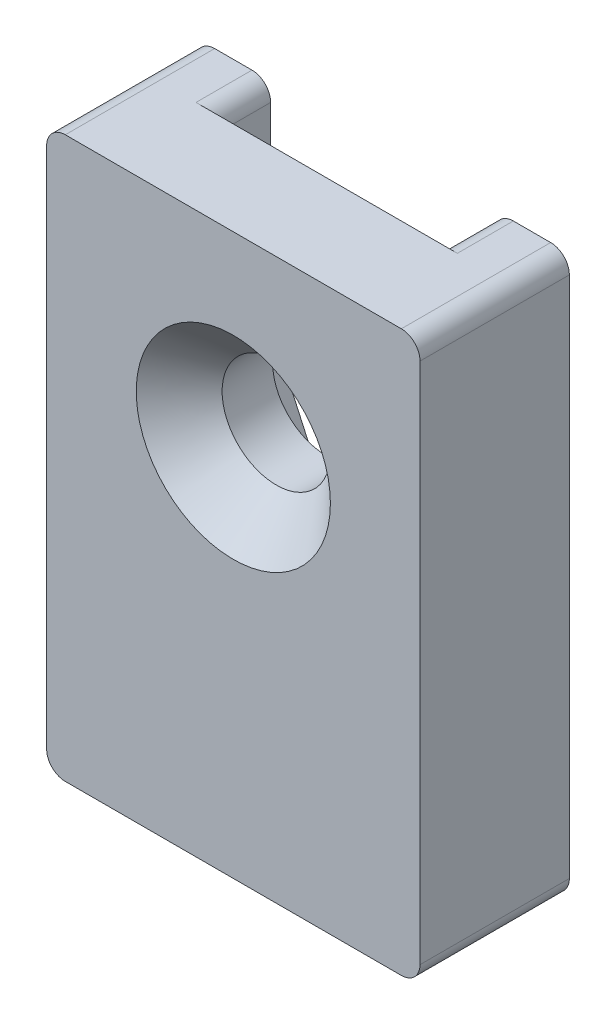
ISO-10303-21;
HEADER;
FILE_DESCRIPTION(('STEP AP214'),'2;1');
FILE_NAME('part.step','',(''),(''),'','','');
FILE_SCHEMA(('AUTOMOTIVE_DESIGN { 1 0 10303 214 1 1 1 1 }'));
ENDSEC;
DATA;
#1=APPLICATION_CONTEXT('core data for automotive mechanical design processes');
#2=APPLICATION_PROTOCOL_DEFINITION('international standard','automotive_design',2000,#1);
#3=PRODUCT_CONTEXT('',#1,'mechanical');
#4=PRODUCT('Part','Part','',(#3));
#5=PRODUCT_RELATED_PRODUCT_CATEGORY('part','',(#4));
#6=PRODUCT_DEFINITION_FORMATION('','',#4);
#7=PRODUCT_DEFINITION_CONTEXT('part definition',#1,'design');
#8=PRODUCT_DEFINITION('design','',#6,#7);
#9=PRODUCT_DEFINITION_SHAPE('','',#8);
#10=(LENGTH_UNIT() NAMED_UNIT(*) SI_UNIT(.MILLI.,.METRE.));
#11=(NAMED_UNIT(*) PLANE_ANGLE_UNIT() SI_UNIT($,.RADIAN.));
#12=(NAMED_UNIT(*) SI_UNIT($,.STERADIAN.) SOLID_ANGLE_UNIT());
#13=UNCERTAINTY_MEASURE_WITH_UNIT(LENGTH_MEASURE(1.E-05),#10,'distance_accuracy_value','');
#14=(GEOMETRIC_REPRESENTATION_CONTEXT(3) GLOBAL_UNCERTAINTY_ASSIGNED_CONTEXT((#13)) GLOBAL_UNIT_ASSIGNED_CONTEXT((#10,
#11,#12)) REPRESENTATION_CONTEXT('',''));
#15=CARTESIAN_POINT('',(0.,0.,0.));
#16=DIRECTION('',(0.,0.,1.));
#17=DIRECTION('',(1.,0.,0.));
#18=AXIS2_PLACEMENT_3D('',#15,#16,#17);
#19=CARTESIAN_POINT('',(-6.,15.,-1.));
#20=DIRECTION('',(-1.,0.,0.));
#21=DIRECTION('',(0.,-1.,0.));
#22=AXIS2_PLACEMENT_3D('',#19,#20,#21);
#23=PLANE('',#22);
#24=DIRECTION('',(0.,1.,0.));
#25=VECTOR('',#24,1.);
#26=CARTESIAN_POINT('',(-6.,15.,-4.));
#27=LINE('',#26,#25);
#28=CARTESIAN_POINT('',(-6.,5.,-4.));
#29=VERTEX_POINT('',#28);
#30=CARTESIAN_POINT('',(-6.,14.,-4.));
#31=VERTEX_POINT('',#30);
#32=EDGE_CURVE('E206',#29,#31,#27,.T.);
#33=ORIENTED_EDGE('',*,*,#32,.T.);
#34=DIRECTION('',(0.,0.,-1.));
#35=VECTOR('',#34,1.);
#36=CARTESIAN_POINT('',(-6.,14.,-1.));
#37=LINE('',#36,#35);
#38=CARTESIAN_POINT('',(-6.,14.,-1.));
#39=VERTEX_POINT('',#38);
#40=EDGE_CURVE('E62',#31,#39,#37,.F.);
#41=ORIENTED_EDGE('',*,*,#40,.T.);
#42=DIRECTION('',(0.,1.,0.));
#43=VECTOR('',#42,1.);
#44=CARTESIAN_POINT('',(-6.,15.,-1.));
#45=LINE('',#44,#43);
#46=CARTESIAN_POINT('',(-6.,5.,-1.));
#47=VERTEX_POINT('',#46);
#48=EDGE_CURVE('E209',#47,#39,#45,.T.);
#49=ORIENTED_EDGE('',*,*,#48,.F.);
#50=DIRECTION('',(0.,0.,1.));
#51=VECTOR('',#50,1.);
#52=CARTESIAN_POINT('',(-6.,5.,-25.7313138121007));
#53=LINE('',#52,#51);
#54=EDGE_CURVE('E176',#29,#47,#53,.T.);
#55=ORIENTED_EDGE('',*,*,#54,.F.);
#56=EDGE_LOOP('',(#33,#41,#49,#55));
#57=FACE_BOUND('',#56,.T.);
#58=ADVANCED_FACE('F39',(#57),#23,.F.);
#59=CARTESIAN_POINT('',(0.,0.,-1.));
#60=DIRECTION('',(0.,0.,-1.));
#61=DIRECTION('',(-1.,0.,0.));
#62=AXIS2_PLACEMENT_3D('',#59,#60,#61);
#63=PLANE('',#62);
#64=CARTESIAN_POINT('',(0.,5.,-1.));
#65=DIRECTION('',(0.,0.,-1.));
#66=DIRECTION('',(-1.,0.,0.));
#67=AXIS2_PLACEMENT_3D('',#64,#65,#66);
#68=CIRCLE('',#67,2.89999999999999);
#69=CARTESIAN_POINT('',(-2.89999999999999,5.,-1.));
#70=VERTEX_POINT('',#69);
#71=EDGE_CURVE('E200',#70,#70,#68,.T.);
#72=ORIENTED_EDGE('',*,*,#71,.F.);
#73=EDGE_LOOP('',(#72));
#74=FACE_BOUND('',#73,.T.);
#75=DIRECTION('',(-1.,0.,0.));
#76=VECTOR('',#75,1.);
#77=CARTESIAN_POINT('',(5.99999999999999,-15.,-1.));
#78=LINE('',#77,#76);
#79=CARTESIAN_POINT('',(7.,-15.,-1.));
#80=VERTEX_POINT('',#79);
#81=CARTESIAN_POINT('',(0.947008471079007,-15.,-1.));
#82=VERTEX_POINT('',#81);
#83=EDGE_CURVE('E205',#80,#82,#78,.T.);
#84=ORIENTED_EDGE('',*,*,#83,.T.);
#85=CARTESIAN_POINT('',(0.947008471079007,-14.,-1.));
#86=DIRECTION('',(0.,0.,-1.));
#87=DIRECTION('',(-1.,0.,0.));
#88=AXIS2_PLACEMENT_3D('',#85,#86,#87);
#89=CIRCLE('',#88,1.);
#90=CARTESIAN_POINT('',(1.85737801716609,-13.5862038067391,-1.));
#91=VERTEX_POINT('',#90);
#92=EDGE_CURVE('E48',#82,#91,#89,.F.);
#93=ORIENTED_EDGE('',*,*,#92,.T.);
#94=DIRECTION('',(0.413796193260886,-0.910369546087082,0.));
#95=VECTOR('',#94,1.);
#96=CARTESIAN_POINT('',(-5.4622172765225,2.51722284043469,-1.));
#97=LINE('',#96,#95);
#98=CARTESIAN_POINT('',(-5.4622172765225,2.51722284043469,-1.));
#99=VERTEX_POINT('',#98);
#100=EDGE_CURVE('E169',#99,#91,#97,.T.);
#101=ORIENTED_EDGE('',*,*,#100,.F.);
#102=CARTESIAN_POINT('',(0.,5.,-1.));
#103=DIRECTION('',(0.,0.,1.));
#104=DIRECTION('',(1.,0.,0.));
#105=AXIS2_PLACEMENT_3D('',#102,#103,#104);
#106=CIRCLE('',#105,6.00000000000001);
#107=EDGE_CURVE('E179',#47,#99,#106,.T.);
#108=ORIENTED_EDGE('',*,*,#107,.F.);
#109=ORIENTED_EDGE('',*,*,#48,.T.);
#110=CARTESIAN_POINT('',(-7.,14.,-1.));
#111=DIRECTION('',(0.,0.,-1.));
#112=DIRECTION('',(-1.,0.,0.));
#113=AXIS2_PLACEMENT_3D('',#110,#111,#112);
#114=CIRCLE('',#113,1.);
#115=CARTESIAN_POINT('',(-7.,15.,-1.));
#116=VERTEX_POINT('',#115);
#117=EDGE_CURVE('E353',#39,#116,#114,.F.);
#118=ORIENTED_EDGE('',*,*,#117,.T.);
#119=DIRECTION('',(1.,0.,0.));
#120=VECTOR('',#119,1.);
#121=CARTESIAN_POINT('',(6.,15.,-1.));
#122=LINE('',#121,#120);
#123=CARTESIAN_POINT('',(7.,15.,-1.));
#124=VERTEX_POINT('',#123);
#125=EDGE_CURVE('E212',#116,#124,#122,.T.);
#126=ORIENTED_EDGE('',*,*,#125,.T.);
#127=CARTESIAN_POINT('',(7.,14.,-1.));
#128=DIRECTION('',(0.,0.,-1.));
#129=DIRECTION('',(-1.,0.,0.));
#130=AXIS2_PLACEMENT_3D('',#127,#128,#129);
#131=CIRCLE('',#130,1.);
#132=CARTESIAN_POINT('',(6.,14.,-1.));
#133=VERTEX_POINT('',#132);
#134=EDGE_CURVE('E350',#124,#133,#131,.F.);
#135=ORIENTED_EDGE('',*,*,#134,.T.);
#136=DIRECTION('',(0.,-1.,0.));
#137=VECTOR('',#136,1.);
#138=CARTESIAN_POINT('',(6.,15.,-1.));
#139=LINE('',#138,#137);
#140=CARTESIAN_POINT('',(5.99999999999999,-14.,-1.));
#141=VERTEX_POINT('',#140);
#142=EDGE_CURVE('E201',#133,#141,#139,.T.);
#143=ORIENTED_EDGE('',*,*,#142,.T.);
#144=CARTESIAN_POINT('',(7.,-14.,-1.));
#145=DIRECTION('',(0.,0.,-1.));
#146=DIRECTION('',(-1.,0.,0.));
#147=AXIS2_PLACEMENT_3D('',#144,#145,#146);
#148=CIRCLE('',#147,1.);
#149=EDGE_CURVE('E11',#141,#80,#148,.F.);
#150=ORIENTED_EDGE('',*,*,#149,.T.);
#151=EDGE_LOOP('',(#84,#93,#101,#108,#109,#118,#126,#135,#143,#150));
#152=FACE_BOUND('',#151,.T.);
#153=ADVANCED_FACE('F184',(#74,#152),#63,.T.);
#154=CARTESIAN_POINT('',(0.,0.,-4.));
#155=DIRECTION('',(0.,0.,1.));
#156=DIRECTION('',(1.,0.,0.));
#157=AXIS2_PLACEMENT_3D('',#154,#155,#156);
#158=PLANE('',#157);
#159=DIRECTION('',(-1.,0.,0.));
#160=VECTOR('',#159,1.);
#161=CARTESIAN_POINT('',(-10.,15.,-4.));
#162=LINE('',#161,#160);
#163=CARTESIAN_POINT('',(8.99999999999999,15.,-4.));
#164=VERTEX_POINT('',#163);
#165=CARTESIAN_POINT('',(7.,15.,-4.));
#166=VERTEX_POINT('',#165);
#167=EDGE_CURVE('E237',#164,#166,#162,.T.);
#168=ORIENTED_EDGE('',*,*,#167,.F.);
#169=CARTESIAN_POINT('',(8.99999999999999,14.,-4.));
#170=DIRECTION('',(0.,0.,1.));
#171=DIRECTION('',(1.,0.,0.));
#172=AXIS2_PLACEMENT_3D('',#169,#170,#171);
#173=CIRCLE('',#172,1.);
#174=CARTESIAN_POINT('',(9.99999999999999,14.,-4.));
#175=VERTEX_POINT('',#174);
#176=EDGE_CURVE('E320',#164,#175,#173,.F.);
#177=ORIENTED_EDGE('',*,*,#176,.T.);
#178=DIRECTION('',(0.,1.,0.));
#179=VECTOR('',#178,1.);
#180=CARTESIAN_POINT('',(9.99999999999999,15.,-4.));
#181=LINE('',#180,#179);
#182=CARTESIAN_POINT('',(10.,-14.,-4.));
#183=VERTEX_POINT('',#182);
#184=EDGE_CURVE('E232',#183,#175,#181,.T.);
#185=ORIENTED_EDGE('',*,*,#184,.F.);
#186=CARTESIAN_POINT('',(9.,-14.,-4.));
#187=DIRECTION('',(0.,0.,1.));
#188=DIRECTION('',(1.,0.,0.));
#189=AXIS2_PLACEMENT_3D('',#186,#187,#188);
#190=CIRCLE('',#189,1.);
#191=CARTESIAN_POINT('',(9.,-15.,-4.));
#192=VERTEX_POINT('',#191);
#193=EDGE_CURVE('E317',#183,#192,#190,.F.);
#194=ORIENTED_EDGE('',*,*,#193,.T.);
#195=DIRECTION('',(1.,0.,0.));
#196=VECTOR('',#195,1.);
#197=CARTESIAN_POINT('',(-10.,-15.,-4.));
#198=LINE('',#197,#196);
#199=CARTESIAN_POINT('',(7.,-15.,-4.));
#200=VERTEX_POINT('',#199);
#201=EDGE_CURVE('E226',#200,#192,#198,.T.);
#202=ORIENTED_EDGE('',*,*,#201,.F.);
#203=CARTESIAN_POINT('',(7.,-14.,-4.));
#204=DIRECTION('',(0.,0.,1.));
#205=DIRECTION('',(1.,0.,0.));
#206=AXIS2_PLACEMENT_3D('',#203,#204,#205);
#207=CIRCLE('',#206,1.);
#208=CARTESIAN_POINT('',(5.99999999999999,-14.,-4.));
#209=VERTEX_POINT('',#208);
#210=EDGE_CURVE('E311',#200,#209,#207,.F.);
#211=ORIENTED_EDGE('',*,*,#210,.T.);
#212=DIRECTION('',(0.,-1.,0.));
#213=VECTOR('',#212,1.);
#214=CARTESIAN_POINT('',(6.,15.,-4.));
#215=LINE('',#214,#213);
#216=CARTESIAN_POINT('',(6.,14.,-4.));
#217=VERTEX_POINT('',#216);
#218=EDGE_CURVE('E216',#217,#209,#215,.T.);
#219=ORIENTED_EDGE('',*,*,#218,.F.);
#220=CARTESIAN_POINT('',(7.,14.,-4.));
#221=DIRECTION('',(0.,0.,1.));
#222=DIRECTION('',(1.,0.,0.));
#223=AXIS2_PLACEMENT_3D('',#220,#221,#222);
#224=CIRCLE('',#223,1.);
#225=EDGE_CURVE('E314',#217,#166,#224,.F.);
#226=ORIENTED_EDGE('',*,*,#225,.T.);
#227=EDGE_LOOP('',(#168,#177,#185,#194,#202,#211,#219,#226));
#228=FACE_BOUND('',#227,.T.);
#229=ADVANCED_FACE('F389',(#228),#158,.F.);
#230=CARTESIAN_POINT('',(-10.,15.,-4.));
#231=DIRECTION('',(-1.,0.,0.));
#232=DIRECTION('',(0.,-1.,0.));
#233=AXIS2_PLACEMENT_3D('',#230,#231,#232);
#234=PLANE('',#233);
#235=DIRECTION('',(0.,-1.,0.));
#236=VECTOR('',#235,1.);
#237=CARTESIAN_POINT('',(-10.,15.,4.));
#238=LINE('',#237,#236);
#239=CARTESIAN_POINT('',(-10.,14.,4.));
#240=VERTEX_POINT('',#239);
#241=CARTESIAN_POINT('',(-10.,-14.,4.));
#242=VERTEX_POINT('',#241);
#243=EDGE_CURVE('E215',#240,#242,#238,.T.);
#244=ORIENTED_EDGE('',*,*,#243,.F.);
#245=DIRECTION('',(0.,0.,1.));
#246=VECTOR('',#245,1.);
#247=CARTESIAN_POINT('',(-10.,14.,-4.));
#248=LINE('',#247,#246);
#249=CARTESIAN_POINT('',(-10.,14.,-4.));
#250=VERTEX_POINT('',#249);
#251=EDGE_CURVE('E289',#240,#250,#248,.F.);
#252=ORIENTED_EDGE('',*,*,#251,.T.);
#253=DIRECTION('',(0.,-1.,0.));
#254=VECTOR('',#253,1.);
#255=CARTESIAN_POINT('',(-10.,15.,-4.));
#256=LINE('',#255,#254);
#257=CARTESIAN_POINT('',(-10.,-14.,-4.));
#258=VERTEX_POINT('',#257);
#259=EDGE_CURVE('E222',#250,#258,#256,.T.);
#260=ORIENTED_EDGE('',*,*,#259,.T.);
#261=DIRECTION('',(0.,0.,1.));
#262=VECTOR('',#261,1.);
#263=CARTESIAN_POINT('',(-10.,-14.,-4.));
#264=LINE('',#263,#262);
#265=EDGE_CURVE('E285',#258,#242,#264,.T.);
#266=ORIENTED_EDGE('',*,*,#265,.T.);
#267=EDGE_LOOP('',(#244,#252,#260,#266));
#268=FACE_BOUND('',#267,.T.);
#269=ADVANCED_FACE('F423',(#268),#234,.T.);
#270=CARTESIAN_POINT('',(-10.,15.,-4.));
#271=DIRECTION('',(0.,1.,0.));
#272=DIRECTION('',(-1.,0.,0.));
#273=AXIS2_PLACEMENT_3D('',#270,#271,#272);
#274=PLANE('',#273);
#275=CARTESIAN_POINT('',(-7.,15.,-4.));
#276=VERTEX_POINT('',#275);
#277=CARTESIAN_POINT('',(-9.00000000000001,15.,-4.));
#278=VERTEX_POINT('',#277);
#279=EDGE_CURVE('E236',#276,#278,#162,.T.);
#280=ORIENTED_EDGE('',*,*,#279,.T.);
#281=DIRECTION('',(0.,0.,1.));
#282=VECTOR('',#281,1.);
#283=CARTESIAN_POINT('',(-9.00000000000001,15.,-4.));
#284=LINE('',#283,#282);
#285=CARTESIAN_POINT('',(-9.00000000000001,15.,4.));
#286=VERTEX_POINT('',#285);
#287=EDGE_CURVE('E269',#278,#286,#284,.T.);
#288=ORIENTED_EDGE('',*,*,#287,.T.);
#289=DIRECTION('',(-1.,0.,0.));
#290=VECTOR('',#289,1.);
#291=CARTESIAN_POINT('',(-10.,15.,4.));
#292=LINE('',#291,#290);
#293=CARTESIAN_POINT('',(8.99999999999999,15.,4.));
#294=VERTEX_POINT('',#293);
#295=EDGE_CURVE('E227',#294,#286,#292,.T.);
#296=ORIENTED_EDGE('',*,*,#295,.F.);
#297=DIRECTION('',(0.,0.,1.));
#298=VECTOR('',#297,1.);
#299=CARTESIAN_POINT('',(8.99999999999999,15.,-4.));
#300=LINE('',#299,#298);
#301=EDGE_CURVE('E266',#294,#164,#300,.F.);
#302=ORIENTED_EDGE('',*,*,#301,.T.);
#303=ORIENTED_EDGE('',*,*,#167,.T.);
#304=DIRECTION('',(0.,0.,-1.));
#305=VECTOR('',#304,1.);
#306=CARTESIAN_POINT('',(7.,15.,-1.));
#307=LINE('',#306,#305);
#308=EDGE_CURVE('E262',#166,#124,#307,.F.);
#309=ORIENTED_EDGE('',*,*,#308,.T.);
#310=ORIENTED_EDGE('',*,*,#125,.F.);
#311=DIRECTION('',(0.,0.,-1.));
#312=VECTOR('',#311,1.);
#313=CARTESIAN_POINT('',(-7.,15.,-4.));
#314=LINE('',#313,#312);
#315=EDGE_CURVE('E241',#116,#276,#314,.T.);
#316=ORIENTED_EDGE('',*,*,#315,.T.);
#317=EDGE_LOOP('',(#280,#288,#296,#302,#303,#309,#310,#316));
#318=FACE_BOUND('',#317,.T.);
#319=ADVANCED_FACE('F374',(#318),#274,.T.);
#320=CARTESIAN_POINT('',(9.99999999999999,15.,-4.));
#321=DIRECTION('',(1.,0.,0.));
#322=DIRECTION('',(0.,1.,0.));
#323=AXIS2_PLACEMENT_3D('',#320,#321,#322);
#324=PLANE('',#323);
#325=ORIENTED_EDGE('',*,*,#184,.T.);
#326=DIRECTION('',(0.,0.,1.));
#327=VECTOR('',#326,1.);
#328=CARTESIAN_POINT('',(9.99999999999999,14.,-4.));
#329=LINE('',#328,#327);
#330=CARTESIAN_POINT('',(9.99999999999999,14.,4.));
#331=VERTEX_POINT('',#330);
#332=EDGE_CURVE('E307',#175,#331,#329,.T.);
#333=ORIENTED_EDGE('',*,*,#332,.T.);
#334=DIRECTION('',(0.,1.,0.));
#335=VECTOR('',#334,1.);
#336=CARTESIAN_POINT('',(9.99999999999999,15.,4.));
#337=LINE('',#336,#335);
#338=CARTESIAN_POINT('',(10.,-14.,4.));
#339=VERTEX_POINT('',#338);
#340=EDGE_CURVE('E249',#339,#331,#337,.T.);
#341=ORIENTED_EDGE('',*,*,#340,.F.);
#342=DIRECTION('',(0.,0.,1.));
#343=VECTOR('',#342,1.);
#344=CARTESIAN_POINT('',(10.,-14.,-4.));
#345=LINE('',#344,#343);
#346=EDGE_CURVE('E304',#339,#183,#345,.F.);
#347=ORIENTED_EDGE('',*,*,#346,.T.);
#348=EDGE_LOOP('',(#325,#333,#341,#347));
#349=FACE_BOUND('',#348,.T.);
#350=ADVANCED_FACE('F399',(#349),#324,.T.);
#351=CARTESIAN_POINT('',(-10.,-15.,-4.));
#352=DIRECTION('',(0.,-1.,0.));
#353=DIRECTION('',(1.,0.,0.));
#354=AXIS2_PLACEMENT_3D('',#351,#352,#353);
#355=PLANE('',#354);
#356=ORIENTED_EDGE('',*,*,#201,.T.);
#357=DIRECTION('',(0.,0.,1.));
#358=VECTOR('',#357,1.);
#359=CARTESIAN_POINT('',(9.,-15.,-4.));
#360=LINE('',#359,#358);
#361=CARTESIAN_POINT('',(9.,-15.,4.));
#362=VERTEX_POINT('',#361);
#363=EDGE_CURVE('E334',#192,#362,#360,.T.);
#364=ORIENTED_EDGE('',*,*,#363,.T.);
#365=DIRECTION('',(1.,0.,0.));
#366=VECTOR('',#365,1.);
#367=CARTESIAN_POINT('',(-10.,-15.,4.));
#368=LINE('',#367,#366);
#369=CARTESIAN_POINT('',(-9.,-15.,4.));
#370=VERTEX_POINT('',#369);
#371=EDGE_CURVE('E245',#370,#362,#368,.T.);
#372=ORIENTED_EDGE('',*,*,#371,.F.);
#373=DIRECTION('',(0.,0.,1.));
#374=VECTOR('',#373,1.);
#375=CARTESIAN_POINT('',(-9.,-15.,-4.));
#376=LINE('',#375,#374);
#377=CARTESIAN_POINT('',(-9.,-15.,-4.));
#378=VERTEX_POINT('',#377);
#379=EDGE_CURVE('E331',#370,#378,#376,.F.);
#380=ORIENTED_EDGE('',*,*,#379,.T.);
#381=CARTESIAN_POINT('',(0.947008471079007,-15.,-4.));
#382=VERTEX_POINT('',#381);
#383=EDGE_CURVE('E231',#378,#382,#198,.T.);
#384=ORIENTED_EDGE('',*,*,#383,.T.);
#385=DIRECTION('',(0.,0.,1.));
#386=VECTOR('',#385,1.);
#387=CARTESIAN_POINT('',(0.947008471079007,-15.,-1.));
#388=LINE('',#387,#386);
#389=EDGE_CURVE('E327',#382,#82,#388,.T.);
#390=ORIENTED_EDGE('',*,*,#389,.T.);
#391=ORIENTED_EDGE('',*,*,#83,.F.);
#392=DIRECTION('',(0.,0.,-1.));
#393=VECTOR('',#392,1.);
#394=CARTESIAN_POINT('',(7.,-15.,-4.));
#395=LINE('',#394,#393);
#396=EDGE_CURVE('E323',#80,#200,#395,.T.);
#397=ORIENTED_EDGE('',*,*,#396,.T.);
#398=EDGE_LOOP('',(#356,#364,#372,#380,#384,#390,#391,#397));
#399=FACE_BOUND('',#398,.T.);
#400=ADVANCED_FACE('F407',(#399),#355,.T.);
#401=ORIENTED_EDGE('',*,*,#259,.F.);
#402=CARTESIAN_POINT('',(-9.00000000000001,14.,-4.));
#403=DIRECTION('',(0.,0.,1.));
#404=DIRECTION('',(1.,0.,0.));
#405=AXIS2_PLACEMENT_3D('',#402,#403,#404);
#406=CIRCLE('',#405,1.);
#407=EDGE_CURVE('E301',#250,#278,#406,.F.);
#408=ORIENTED_EDGE('',*,*,#407,.T.);
#409=ORIENTED_EDGE('',*,*,#279,.F.);
#410=CARTESIAN_POINT('',(-7.,14.,-4.));
#411=DIRECTION('',(0.,0.,1.));
#412=DIRECTION('',(1.,0.,0.));
#413=AXIS2_PLACEMENT_3D('',#410,#411,#412);
#414=CIRCLE('',#413,1.);
#415=EDGE_CURVE('E295',#276,#31,#414,.F.);
#416=ORIENTED_EDGE('',*,*,#415,.T.);
#417=ORIENTED_EDGE('',*,*,#32,.F.);
#418=CARTESIAN_POINT('',(0.,5.,-4.));
#419=DIRECTION('',(0.,0.,1.));
#420=DIRECTION('',(1.,0.,0.));
#421=AXIS2_PLACEMENT_3D('',#418,#419,#420);
#422=CIRCLE('',#421,6.00000000000001);
#423=CARTESIAN_POINT('',(-5.4622172765225,2.51722284043469,-4.));
#424=VERTEX_POINT('',#423);
#425=EDGE_CURVE('E196',#424,#29,#422,.F.);
#426=ORIENTED_EDGE('',*,*,#425,.F.);
#427=DIRECTION('',(-0.413796193260886,0.910369546087082,0.));
#428=VECTOR('',#427,1.);
#429=CARTESIAN_POINT('',(-5.4622172765225,2.51722284043469,-4.));
#430=LINE('',#429,#428);
#431=CARTESIAN_POINT('',(1.85737801716609,-13.5862038067391,-4.));
#432=VERTEX_POINT('',#431);
#433=EDGE_CURVE('E172',#432,#424,#430,.T.);
#434=ORIENTED_EDGE('',*,*,#433,.F.);
#435=CARTESIAN_POINT('',(0.947008471079007,-14.,-4.));
#436=DIRECTION('',(0.,0.,1.));
#437=DIRECTION('',(1.,0.,0.));
#438=AXIS2_PLACEMENT_3D('',#435,#436,#437);
#439=CIRCLE('',#438,1.);
#440=EDGE_CURVE('E292',#432,#382,#439,.F.);
#441=ORIENTED_EDGE('',*,*,#440,.T.);
#442=ORIENTED_EDGE('',*,*,#383,.F.);
#443=CARTESIAN_POINT('',(-9.,-14.,-4.));
#444=DIRECTION('',(0.,0.,1.));
#445=DIRECTION('',(1.,0.,0.));
#446=AXIS2_PLACEMENT_3D('',#443,#444,#445);
#447=CIRCLE('',#446,1.);
#448=EDGE_CURVE('E298',#378,#258,#447,.F.);
#449=ORIENTED_EDGE('',*,*,#448,.T.);
#450=EDGE_LOOP('',(#401,#408,#409,#416,#417,#426,#434,#441,#442,#449));
#451=FACE_BOUND('',#450,.T.);
#452=ADVANCED_FACE('F367',(#451),#158,.F.);
#453=CARTESIAN_POINT('',(0.,0.,4.));
#454=DIRECTION('',(0.,0.,1.));
#455=DIRECTION('',(1.,0.,0.));
#456=AXIS2_PLACEMENT_3D('',#453,#454,#455);
#457=PLANE('',#456);
#458=CARTESIAN_POINT('',(0.,5.,4.));
#459=DIRECTION('',(0.,0.,1.));
#460=DIRECTION('',(1.,0.,0.));
#461=AXIS2_PLACEMENT_3D('',#458,#459,#460);
#462=CIRCLE('',#461,5.2);
#463=CARTESIAN_POINT('',(5.2,5.,4.));
#464=VERTEX_POINT('',#463);
#465=EDGE_CURVE('E191',#464,#464,#462,.T.);
#466=ORIENTED_EDGE('',*,*,#465,.F.);
#467=EDGE_LOOP('',(#466));
#468=FACE_BOUND('',#467,.T.);
#469=ORIENTED_EDGE('',*,*,#295,.T.);
#470=CARTESIAN_POINT('',(-9.00000000000001,14.,4.));
#471=DIRECTION('',(0.,0.,1.));
#472=DIRECTION('',(1.,0.,0.));
#473=AXIS2_PLACEMENT_3D('',#470,#471,#472);
#474=CIRCLE('',#473,1.);
#475=EDGE_CURVE('E282',#286,#240,#474,.T.);
#476=ORIENTED_EDGE('',*,*,#475,.T.);
#477=ORIENTED_EDGE('',*,*,#243,.T.);
#478=CARTESIAN_POINT('',(-9.,-14.,4.));
#479=DIRECTION('',(0.,0.,1.));
#480=DIRECTION('',(1.,0.,0.));
#481=AXIS2_PLACEMENT_3D('',#478,#479,#480);
#482=CIRCLE('',#481,1.);
#483=EDGE_CURVE('E273',#242,#370,#482,.T.);
#484=ORIENTED_EDGE('',*,*,#483,.T.);
#485=ORIENTED_EDGE('',*,*,#371,.T.);
#486=CARTESIAN_POINT('',(9.,-14.,4.));
#487=DIRECTION('',(0.,0.,1.));
#488=DIRECTION('',(1.,0.,0.));
#489=AXIS2_PLACEMENT_3D('',#486,#487,#488);
#490=CIRCLE('',#489,1.);
#491=EDGE_CURVE('E276',#362,#339,#490,.T.);
#492=ORIENTED_EDGE('',*,*,#491,.T.);
#493=ORIENTED_EDGE('',*,*,#340,.T.);
#494=CARTESIAN_POINT('',(8.99999999999999,14.,4.));
#495=DIRECTION('',(0.,0.,1.));
#496=DIRECTION('',(1.,0.,0.));
#497=AXIS2_PLACEMENT_3D('',#494,#495,#496);
#498=CIRCLE('',#497,1.);
#499=EDGE_CURVE('E279',#331,#294,#498,.T.);
#500=ORIENTED_EDGE('',*,*,#499,.T.);
#501=EDGE_LOOP('',(#469,#476,#477,#484,#485,#492,#493,#500));
#502=FACE_BOUND('',#501,.T.);
#503=ADVANCED_FACE('F426',(#468,#502),#457,.T.);
#504=CARTESIAN_POINT('',(6.,15.,-1.));
#505=DIRECTION('',(1.,0.,0.));
#506=DIRECTION('',(0.,1.,0.));
#507=AXIS2_PLACEMENT_3D('',#504,#505,#506);
#508=PLANE('',#507);
#509=ORIENTED_EDGE('',*,*,#142,.F.);
#510=DIRECTION('',(0.,0.,-1.));
#511=VECTOR('',#510,1.);
#512=CARTESIAN_POINT('',(6.,14.,-4.));
#513=LINE('',#512,#511);
#514=EDGE_CURVE('E341',#133,#217,#513,.T.);
#515=ORIENTED_EDGE('',*,*,#514,.T.);
#516=ORIENTED_EDGE('',*,*,#218,.T.);
#517=DIRECTION('',(0.,0.,-1.));
#518=VECTOR('',#517,1.);
#519=CARTESIAN_POINT('',(5.99999999999999,-14.,-1.));
#520=LINE('',#519,#518);
#521=EDGE_CURVE('E338',#209,#141,#520,.F.);
#522=ORIENTED_EDGE('',*,*,#521,.T.);
#523=EDGE_LOOP('',(#509,#515,#516,#522));
#524=FACE_BOUND('',#523,.T.);
#525=ADVANCED_FACE('F383',(#524),#508,.F.);
#526=CARTESIAN_POINT('',(0.,5.,4.));
#527=DIRECTION('',(0.,0.,1.));
#528=DIRECTION('',(1.,0.,0.));
#529=AXIS2_PLACEMENT_3D('',#526,#527,#528);
#530=CYLINDRICAL_SURFACE('',#529,2.89999999999999);
#531=ORIENTED_EDGE('',*,*,#71,.T.);
#532=EDGE_LOOP('',(#531));
#533=FACE_BOUND('',#532,.T.);
#534=CARTESIAN_POINT('',(0.,5.,1.7));
#535=DIRECTION('',(0.,0.,1.));
#536=DIRECTION('',(1.,0.,0.));
#537=AXIS2_PLACEMENT_3D('',#534,#535,#536);
#538=CIRCLE('',#537,2.89999999999999);
#539=CARTESIAN_POINT('',(2.89999999999999,5.,1.7));
#540=VERTEX_POINT('',#539);
#541=EDGE_CURVE('E195',#540,#540,#538,.T.);
#542=ORIENTED_EDGE('',*,*,#541,.T.);
#543=EDGE_LOOP('',(#542));
#544=FACE_BOUND('',#543,.T.);
#545=ADVANCED_FACE('F450',(#533,#544),#530,.F.);
#546=CARTESIAN_POINT('',(0.,5.,4.));
#547=DIRECTION('',(0.,0.,1.));
#548=DIRECTION('',(1.,0.,0.));
#549=AXIS2_PLACEMENT_3D('',#546,#547,#548);
#550=CONICAL_SURFACE('',#549,5.2,0.785398163397451);
#551=ORIENTED_EDGE('',*,*,#541,.F.);
#552=EDGE_LOOP('',(#551));
#553=FACE_BOUND('',#552,.T.);
#554=ORIENTED_EDGE('',*,*,#465,.T.);
#555=EDGE_LOOP('',(#554));
#556=FACE_BOUND('',#555,.T.);
#557=ADVANCED_FACE('F491',(#553,#556),#550,.F.);
#558=CARTESIAN_POINT('',(-5.4622172765225,2.51722284043469,-25.7313138121007));
#559=DIRECTION('',(-0.910369546087082,-0.413796193260886,0.));
#560=DIRECTION('',(0.413796193260886,-0.910369546087082,0.));
#561=AXIS2_PLACEMENT_3D('',#558,#559,#560);
#562=PLANE('',#561);
#563=ORIENTED_EDGE('',*,*,#100,.T.);
#564=DIRECTION('',(0.,0.,1.));
#565=VECTOR('',#564,1.);
#566=CARTESIAN_POINT('',(1.85737801716609,-13.5862038067391,-4.));
#567=LINE('',#566,#565);
#568=EDGE_CURVE('E347',#91,#432,#567,.F.);
#569=ORIENTED_EDGE('',*,*,#568,.T.);
#570=ORIENTED_EDGE('',*,*,#433,.T.);
#571=DIRECTION('',(0.,0.,1.));
#572=VECTOR('',#571,1.);
#573=CARTESIAN_POINT('',(-5.4622172765225,2.51722284043469,-25.7313138121007));
#574=LINE('',#573,#572);
#575=EDGE_CURVE('E166',#424,#99,#574,.T.);
#576=ORIENTED_EDGE('',*,*,#575,.T.);
#577=EDGE_LOOP('',(#563,#569,#570,#576));
#578=FACE_BOUND('',#577,.T.);
#579=ADVANCED_FACE('F168',(#578),#562,.F.);
#580=CARTESIAN_POINT('',(0.,5.,-25.7313138121007));
#581=DIRECTION('',(0.,0.,1.));
#582=DIRECTION('',(1.,0.,0.));
#583=AXIS2_PLACEMENT_3D('',#580,#581,#582);
#584=CYLINDRICAL_SURFACE('',#583,6.00000000000001);
#585=ORIENTED_EDGE('',*,*,#575,.F.);
#586=ORIENTED_EDGE('',*,*,#425,.T.);
#587=ORIENTED_EDGE('',*,*,#54,.T.);
#588=ORIENTED_EDGE('',*,*,#107,.T.);
#589=EDGE_LOOP('',(#585,#586,#587,#588));
#590=FACE_BOUND('',#589,.T.);
#591=ADVANCED_FACE('F180',(#590),#584,.F.);
#592=CARTESIAN_POINT('',(-9.00000000000001,14.,-4.));
#593=DIRECTION('',(0.,0.,1.));
#594=DIRECTION('',(1.,0.,0.));
#595=AXIS2_PLACEMENT_3D('',#592,#593,#594);
#596=CYLINDRICAL_SURFACE('',#595,1.);
#597=ORIENTED_EDGE('',*,*,#407,.F.);
#598=ORIENTED_EDGE('',*,*,#251,.F.);
#599=ORIENTED_EDGE('',*,*,#475,.F.);
#600=ORIENTED_EDGE('',*,*,#287,.F.);
#601=EDGE_LOOP('',(#597,#598,#599,#600));
#602=FACE_BOUND('',#601,.T.);
#603=ADVANCED_FACE('F429',(#602),#596,.T.);
#604=CARTESIAN_POINT('',(8.99999999999999,14.,-4.));
#605=DIRECTION('',(0.,0.,1.));
#606=DIRECTION('',(1.,0.,0.));
#607=AXIS2_PLACEMENT_3D('',#604,#605,#606);
#608=CYLINDRICAL_SURFACE('',#607,1.);
#609=ORIENTED_EDGE('',*,*,#176,.F.);
#610=ORIENTED_EDGE('',*,*,#301,.F.);
#611=ORIENTED_EDGE('',*,*,#499,.F.);
#612=ORIENTED_EDGE('',*,*,#332,.F.);
#613=EDGE_LOOP('',(#609,#610,#611,#612));
#614=FACE_BOUND('',#613,.T.);
#615=ADVANCED_FACE('F394',(#614),#608,.T.);
#616=CARTESIAN_POINT('',(9.,-14.,-4.));
#617=DIRECTION('',(0.,0.,1.));
#618=DIRECTION('',(1.,0.,0.));
#619=AXIS2_PLACEMENT_3D('',#616,#617,#618);
#620=CYLINDRICAL_SURFACE('',#619,1.);
#621=ORIENTED_EDGE('',*,*,#193,.F.);
#622=ORIENTED_EDGE('',*,*,#346,.F.);
#623=ORIENTED_EDGE('',*,*,#491,.F.);
#624=ORIENTED_EDGE('',*,*,#363,.F.);
#625=EDGE_LOOP('',(#621,#622,#623,#624));
#626=FACE_BOUND('',#625,.T.);
#627=ADVANCED_FACE('F403',(#626),#620,.T.);
#628=CARTESIAN_POINT('',(-9.,-14.,-4.));
#629=DIRECTION('',(0.,0.,1.));
#630=DIRECTION('',(1.,0.,0.));
#631=AXIS2_PLACEMENT_3D('',#628,#629,#630);
#632=CYLINDRICAL_SURFACE('',#631,1.);
#633=ORIENTED_EDGE('',*,*,#448,.F.);
#634=ORIENTED_EDGE('',*,*,#379,.F.);
#635=ORIENTED_EDGE('',*,*,#483,.F.);
#636=ORIENTED_EDGE('',*,*,#265,.F.);
#637=EDGE_LOOP('',(#633,#634,#635,#636));
#638=FACE_BOUND('',#637,.T.);
#639=ADVANCED_FACE('F420',(#638),#632,.T.);
#640=CARTESIAN_POINT('',(7.,14.,-1.));
#641=DIRECTION('',(0.,0.,1.));
#642=DIRECTION('',(1.,0.,0.));
#643=AXIS2_PLACEMENT_3D('',#640,#641,#642);
#644=CYLINDRICAL_SURFACE('',#643,1.);
#645=ORIENTED_EDGE('',*,*,#134,.F.);
#646=ORIENTED_EDGE('',*,*,#308,.F.);
#647=ORIENTED_EDGE('',*,*,#225,.F.);
#648=ORIENTED_EDGE('',*,*,#514,.F.);
#649=EDGE_LOOP('',(#645,#646,#647,#648));
#650=FACE_BOUND('',#649,.T.);
#651=ADVANCED_FACE('F386',(#650),#644,.T.);
#652=CARTESIAN_POINT('',(-7.,14.,-4.));
#653=DIRECTION('',(0.,0.,1.));
#654=DIRECTION('',(1.,0.,0.));
#655=AXIS2_PLACEMENT_3D('',#652,#653,#654);
#656=CYLINDRICAL_SURFACE('',#655,1.);
#657=ORIENTED_EDGE('',*,*,#117,.F.);
#658=ORIENTED_EDGE('',*,*,#40,.F.);
#659=ORIENTED_EDGE('',*,*,#415,.F.);
#660=ORIENTED_EDGE('',*,*,#315,.F.);
#661=EDGE_LOOP('',(#657,#658,#659,#660));
#662=FACE_BOUND('',#661,.T.);
#663=ADVANCED_FACE('F372',(#662),#656,.T.);
#664=CARTESIAN_POINT('',(0.947008471079007,-14.,-4.));
#665=DIRECTION('',(0.,0.,-1.));
#666=DIRECTION('',(-1.,0.,0.));
#667=AXIS2_PLACEMENT_3D('',#664,#665,#666);
#668=CYLINDRICAL_SURFACE('',#667,1.);
#669=ORIENTED_EDGE('',*,*,#440,.F.);
#670=ORIENTED_EDGE('',*,*,#568,.F.);
#671=ORIENTED_EDGE('',*,*,#92,.F.);
#672=ORIENTED_EDGE('',*,*,#389,.F.);
#673=EDGE_LOOP('',(#669,#670,#671,#672));
#674=FACE_BOUND('',#673,.T.);
#675=ADVANCED_FACE('F414',(#674),#668,.T.);
#676=CARTESIAN_POINT('',(7.,-14.,-4.));
#677=DIRECTION('',(0.,0.,1.));
#678=DIRECTION('',(1.,0.,0.));
#679=AXIS2_PLACEMENT_3D('',#676,#677,#678);
#680=CYLINDRICAL_SURFACE('',#679,1.);
#681=ORIENTED_EDGE('',*,*,#149,.F.);
#682=ORIENTED_EDGE('',*,*,#521,.F.);
#683=ORIENTED_EDGE('',*,*,#210,.F.);
#684=ORIENTED_EDGE('',*,*,#396,.F.);
#685=EDGE_LOOP('',(#681,#682,#683,#684));
#686=FACE_BOUND('',#685,.T.);
#687=ADVANCED_FACE('F41',(#686),#680,.T.);
#688=CLOSED_SHELL('',(#58,#153,#229,#269,#319,#350,#400,#452,#503,#525,#545,#557,#579,#591,#603,
#615,#627,#639,#651,#663,#675,#687));
#689=MANIFOLD_SOLID_BREP('B2',#688);
#690=ADVANCED_BREP_SHAPE_REPRESENTATION('',(#18,#689),#14);
#691=SHAPE_DEFINITION_REPRESENTATION(#9,#690);
ENDSEC;
END-ISO-10303-21;
